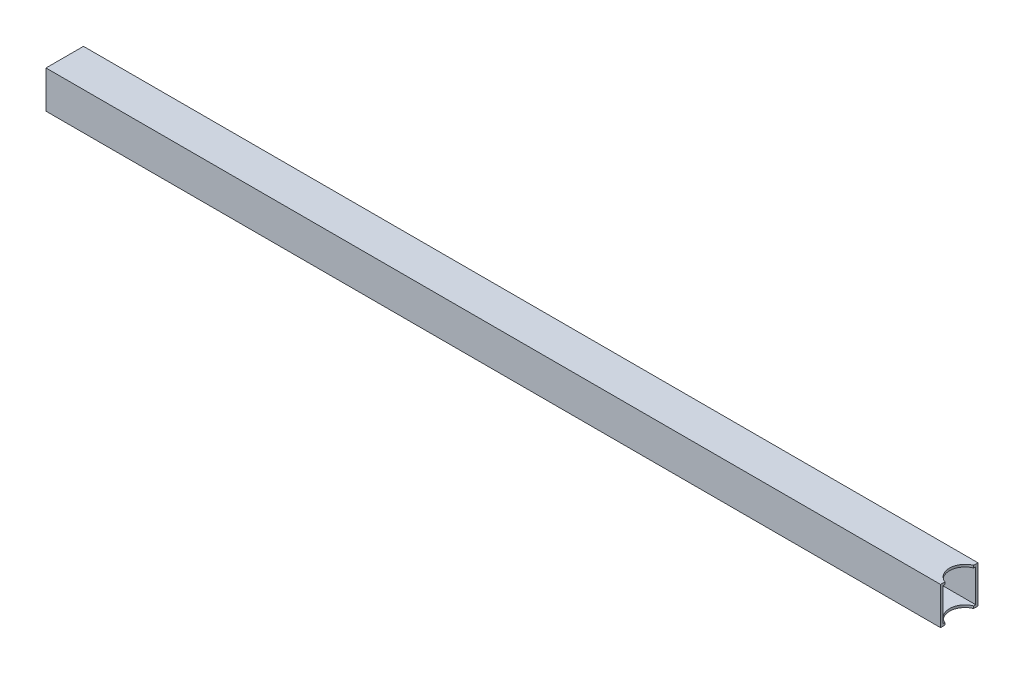
ISO-10303-21;
HEADER;
FILE_DESCRIPTION(('STEP AP214'),'2;1');
FILE_NAME('part.step','',(''),(''),'','','');
FILE_SCHEMA(('AUTOMOTIVE_DESIGN { 1 0 10303 214 1 1 1 1 }'));
ENDSEC;
DATA;
#1=APPLICATION_CONTEXT('core data for automotive mechanical design processes');
#2=APPLICATION_PROTOCOL_DEFINITION('international standard','automotive_design',2000,#1);
#3=PRODUCT_CONTEXT('',#1,'mechanical');
#4=PRODUCT('Part','Part','',(#3));
#5=PRODUCT_RELATED_PRODUCT_CATEGORY('part','',(#4));
#6=PRODUCT_DEFINITION_FORMATION('','',#4);
#7=PRODUCT_DEFINITION_CONTEXT('part definition',#1,'design');
#8=PRODUCT_DEFINITION('design','',#6,#7);
#9=PRODUCT_DEFINITION_SHAPE('','',#8);
#10=(LENGTH_UNIT() NAMED_UNIT(*) SI_UNIT(.MILLI.,.METRE.));
#11=(NAMED_UNIT(*) PLANE_ANGLE_UNIT() SI_UNIT($,.RADIAN.));
#12=(NAMED_UNIT(*) SI_UNIT($,.STERADIAN.) SOLID_ANGLE_UNIT());
#13=UNCERTAINTY_MEASURE_WITH_UNIT(LENGTH_MEASURE(1.E-05),#10,'distance_accuracy_value','');
#14=(GEOMETRIC_REPRESENTATION_CONTEXT(3) GLOBAL_UNCERTAINTY_ASSIGNED_CONTEXT((#13)) GLOBAL_UNIT_ASSIGNED_CONTEXT((#10,
#11,#12)) REPRESENTATION_CONTEXT('',''));
#15=CARTESIAN_POINT('',(0.,0.,0.));
#16=DIRECTION('',(0.,0.,1.));
#17=DIRECTION('',(1.,0.,0.));
#18=AXIS2_PLACEMENT_3D('',#15,#16,#17);
#19=CARTESIAN_POINT('',(622.3,1.66533453693773E-12,0.));
#20=DIRECTION('',(1.,0.,0.));
#21=DIRECTION('',(0.,0.,-1.));
#22=AXIS2_PLACEMENT_3D('',#19,#20,#21);
#23=PLANE('',#22);
#24=DIRECTION('',(0.,1.00000000000001,0.));
#25=VECTOR('',#24,1.);
#26=CARTESIAN_POINT('',(622.3,-25.3999999999987,-19.5306635255949));
#27=LINE('',#26,#25);
#28=CARTESIAN_POINT('',(622.3,-25.3999999999987,-19.5306635255949));
#29=VERTEX_POINT('',#28);
#30=CARTESIAN_POINT('',(622.3,-22.2249999999986,-19.5306635255949));
#31=VERTEX_POINT('',#30);
#32=EDGE_CURVE('E11',#29,#31,#27,.T.);
#33=ORIENTED_EDGE('',*,*,#32,.F.);
#34=DIRECTION('',(0.,0.,-1.));
#35=VECTOR('',#34,1.);
#36=CARTESIAN_POINT('',(622.3,-25.3999999999987,25.4));
#37=LINE('',#36,#35);
#38=CARTESIAN_POINT('',(622.3,-25.3999999999987,-25.4));
#39=VERTEX_POINT('',#38);
#40=EDGE_CURVE('E248',#29,#39,#37,.T.);
#41=ORIENTED_EDGE('',*,*,#40,.T.);
#42=DIRECTION('',(0.,1.00000000000001,0.));
#43=VECTOR('',#42,1.);
#44=CARTESIAN_POINT('',(622.3,-25.3999999999987,-25.4));
#45=LINE('',#44,#43);
#46=CARTESIAN_POINT('',(622.3,25.400000000002,-25.4));
#47=VERTEX_POINT('',#46);
#48=EDGE_CURVE('E152',#39,#47,#45,.T.);
#49=ORIENTED_EDGE('',*,*,#48,.T.);
#50=DIRECTION('',(0.,0.,1.));
#51=VECTOR('',#50,1.);
#52=CARTESIAN_POINT('',(622.3,25.400000000002,-25.4));
#53=LINE('',#52,#51);
#54=CARTESIAN_POINT('',(622.3,25.400000000002,-19.5306635255949));
#55=VERTEX_POINT('',#54);
#56=EDGE_CURVE('E143',#47,#55,#53,.T.);
#57=ORIENTED_EDGE('',*,*,#56,.T.);
#58=CARTESIAN_POINT('',(622.3,22.225000000002,-19.5306635255949));
#59=VERTEX_POINT('',#58);
#60=EDGE_CURVE('E47',#59,#55,#27,.T.);
#61=ORIENTED_EDGE('',*,*,#60,.F.);
#62=DIRECTION('',(0.,0.,1.));
#63=VECTOR('',#62,1.);
#64=CARTESIAN_POINT('',(622.3,22.225000000002,-22.225));
#65=LINE('',#64,#63);
#66=CARTESIAN_POINT('',(622.3,22.225000000002,-22.225));
#67=VERTEX_POINT('',#66);
#68=EDGE_CURVE('E234',#67,#59,#65,.T.);
#69=ORIENTED_EDGE('',*,*,#68,.F.);
#70=DIRECTION('',(0.,1.00000000000001,0.));
#71=VECTOR('',#70,1.);
#72=CARTESIAN_POINT('',(622.3,-22.2249999999986,-22.225));
#73=LINE('',#72,#71);
#74=CARTESIAN_POINT('',(622.3,-22.2249999999986,-22.225));
#75=VERTEX_POINT('',#74);
#76=EDGE_CURVE('E243',#75,#67,#73,.T.);
#77=ORIENTED_EDGE('',*,*,#76,.F.);
#78=DIRECTION('',(0.,0.,-1.));
#79=VECTOR('',#78,1.);
#80=CARTESIAN_POINT('',(622.3,-22.2249999999986,22.225));
#81=LINE('',#80,#79);
#82=EDGE_CURVE('E282',#31,#75,#81,.T.);
#83=ORIENTED_EDGE('',*,*,#82,.F.);
#84=EDGE_LOOP('',(#33,#41,#49,#57,#61,#69,#77,#83));
#85=FACE_BOUND('',#84,.T.);
#86=ADVANCED_FACE('F43',(#85),#23,.T.);
#87=CARTESIAN_POINT('',(-590.55,-25.4000000000019,-25.4));
#88=DIRECTION('',(0.,0.,-1.));
#89=DIRECTION('',(-1.,0.,0.));
#90=AXIS2_PLACEMENT_3D('',#87,#88,#89);
#91=PLANE('',#90);
#92=DIRECTION('',(1.,0.,0.));
#93=VECTOR('',#92,1.);
#94=CARTESIAN_POINT('',(-590.55,25.3999999999987,-25.4));
#95=LINE('',#94,#93);
#96=CARTESIAN_POINT('',(-590.55,25.3999999999987,-25.4));
#97=VERTEX_POINT('',#96);
#98=EDGE_CURVE('E210',#97,#47,#95,.T.);
#99=ORIENTED_EDGE('',*,*,#98,.T.);
#100=ORIENTED_EDGE('',*,*,#48,.F.);
#101=DIRECTION('',(1.,0.,0.));
#102=VECTOR('',#101,1.);
#103=CARTESIAN_POINT('',(-590.55,-25.4000000000019,-25.4));
#104=LINE('',#103,#102);
#105=CARTESIAN_POINT('',(-590.55,-25.4000000000019,-25.4));
#106=VERTEX_POINT('',#105);
#107=EDGE_CURVE('E211',#106,#39,#104,.T.);
#108=ORIENTED_EDGE('',*,*,#107,.F.);
#109=DIRECTION('',(0.,1.00000000000001,0.));
#110=VECTOR('',#109,1.);
#111=CARTESIAN_POINT('',(-590.55,-25.4000000000019,-25.4));
#112=LINE('',#111,#110);
#113=EDGE_CURVE('E185',#106,#97,#112,.T.);
#114=ORIENTED_EDGE('',*,*,#113,.T.);
#115=EDGE_LOOP('',(#99,#100,#108,#114));
#116=FACE_BOUND('',#115,.T.);
#117=ADVANCED_FACE('F45',(#116),#91,.T.);
#118=CARTESIAN_POINT('',(-590.55,-25.4000000000019,25.4));
#119=DIRECTION('',(0.,-1.00000000000001,0.));
#120=DIRECTION('',(0.,0.,-1.));
#121=AXIS2_PLACEMENT_3D('',#118,#119,#120);
#122=PLANE('',#121);
#123=CARTESIAN_POINT('',(630.2375,-25.3999999999987,0.));
#124=DIRECTION('',(0.,1.00000000000001,0.));
#125=DIRECTION('',(0.,0.,1.));
#126=AXIS2_PLACEMENT_3D('',#123,#124,#125);
#127=CIRCLE('',#126,21.0820000000001);
#128=CARTESIAN_POINT('',(622.3,-25.3999999999987,19.5306635255949));
#129=VERTEX_POINT('',#128);
#130=EDGE_CURVE('E147',#29,#129,#127,.T.);
#131=ORIENTED_EDGE('',*,*,#130,.T.);
#132=CARTESIAN_POINT('',(622.3,-25.3999999999987,25.4));
#133=VERTEX_POINT('',#132);
#134=EDGE_CURVE('E253',#133,#129,#37,.T.);
#135=ORIENTED_EDGE('',*,*,#134,.F.);
#136=DIRECTION('',(1.,0.,0.));
#137=VECTOR('',#136,1.);
#138=CARTESIAN_POINT('',(-590.55,-25.4000000000019,25.4));
#139=LINE('',#138,#137);
#140=CARTESIAN_POINT('',(-590.55,-25.4000000000019,25.4));
#141=VERTEX_POINT('',#140);
#142=EDGE_CURVE('E216',#141,#133,#139,.T.);
#143=ORIENTED_EDGE('',*,*,#142,.F.);
#144=DIRECTION('',(0.,0.,-1.));
#145=VECTOR('',#144,1.);
#146=CARTESIAN_POINT('',(-590.55,-25.4000000000019,25.4));
#147=LINE('',#146,#145);
#148=EDGE_CURVE('E206',#141,#106,#147,.T.);
#149=ORIENTED_EDGE('',*,*,#148,.T.);
#150=ORIENTED_EDGE('',*,*,#107,.T.);
#151=ORIENTED_EDGE('',*,*,#40,.F.);
#152=EDGE_LOOP('',(#131,#135,#143,#149,#150,#151));
#153=FACE_BOUND('',#152,.T.);
#154=ADVANCED_FACE('F264',(#153),#122,.T.);
#155=CARTESIAN_POINT('',(-590.55,-25.4000000000019,25.4));
#156=DIRECTION('',(0.,0.,1.));
#157=DIRECTION('',(1.,0.,0.));
#158=AXIS2_PLACEMENT_3D('',#155,#156,#157);
#159=PLANE('',#158);
#160=ORIENTED_EDGE('',*,*,#142,.T.);
#161=DIRECTION('',(0.,-1.00000000000001,0.));
#162=VECTOR('',#161,1.);
#163=CARTESIAN_POINT('',(622.3,25.400000000002,25.4));
#164=LINE('',#163,#162);
#165=CARTESIAN_POINT('',(622.3,25.400000000002,25.4));
#166=VERTEX_POINT('',#165);
#167=EDGE_CURVE('E154',#166,#133,#164,.T.);
#168=ORIENTED_EDGE('',*,*,#167,.F.);
#169=DIRECTION('',(1.,0.,0.));
#170=VECTOR('',#169,1.);
#171=CARTESIAN_POINT('',(-590.55,25.3999999999987,25.4));
#172=LINE('',#171,#170);
#173=CARTESIAN_POINT('',(-590.55,25.3999999999987,25.4));
#174=VERTEX_POINT('',#173);
#175=EDGE_CURVE('E219',#174,#166,#172,.T.);
#176=ORIENTED_EDGE('',*,*,#175,.F.);
#177=DIRECTION('',(0.,-1.00000000000001,0.));
#178=VECTOR('',#177,1.);
#179=CARTESIAN_POINT('',(-590.55,-25.4000000000019,25.4));
#180=LINE('',#179,#178);
#181=EDGE_CURVE('E202',#174,#141,#180,.T.);
#182=ORIENTED_EDGE('',*,*,#181,.T.);
#183=EDGE_LOOP('',(#160,#168,#176,#182));
#184=FACE_BOUND('',#183,.T.);
#185=ADVANCED_FACE('F273',(#184),#159,.T.);
#186=CARTESIAN_POINT('',(-590.55,25.3999999999987,25.4));
#187=DIRECTION('',(0.,1.00000000000001,0.));
#188=DIRECTION('',(0.,0.,1.));
#189=AXIS2_PLACEMENT_3D('',#186,#187,#188);
#190=PLANE('',#189);
#191=CARTESIAN_POINT('',(630.2375,25.400000000002,0.));
#192=DIRECTION('',(0.,1.00000000000001,0.));
#193=DIRECTION('',(0.,0.,1.));
#194=AXIS2_PLACEMENT_3D('',#191,#192,#193);
#195=CIRCLE('',#194,21.0820000000001);
#196=CARTESIAN_POINT('',(622.3,25.400000000002,19.5306635255949));
#197=VERTEX_POINT('',#196);
#198=EDGE_CURVE('E66',#55,#197,#195,.T.);
#199=ORIENTED_EDGE('',*,*,#198,.F.);
#200=ORIENTED_EDGE('',*,*,#56,.F.);
#201=ORIENTED_EDGE('',*,*,#98,.F.);
#202=DIRECTION('',(0.,0.,1.));
#203=VECTOR('',#202,1.);
#204=CARTESIAN_POINT('',(-590.55,25.3999999999987,25.4));
#205=LINE('',#204,#203);
#206=EDGE_CURVE('E198',#97,#174,#205,.T.);
#207=ORIENTED_EDGE('',*,*,#206,.T.);
#208=ORIENTED_EDGE('',*,*,#175,.T.);
#209=EDGE_CURVE('E145',#197,#166,#53,.T.);
#210=ORIENTED_EDGE('',*,*,#209,.F.);
#211=EDGE_LOOP('',(#199,#200,#201,#207,#208,#210));
#212=FACE_BOUND('',#211,.T.);
#213=ADVANCED_FACE('F142',(#212),#190,.T.);
#214=CARTESIAN_POINT('',(-590.55,-1.58206781009085E-12,0.));
#215=DIRECTION('',(-1.,0.,0.));
#216=DIRECTION('',(0.,0.,1.));
#217=AXIS2_PLACEMENT_3D('',#214,#215,#216);
#218=PLANE('',#217);
#219=DIRECTION('',(0.,1.00000000000001,0.));
#220=VECTOR('',#219,1.);
#221=CARTESIAN_POINT('',(-590.55,-22.2250000000018,-22.225));
#222=LINE('',#221,#220);
#223=CARTESIAN_POINT('',(-590.55,-22.2250000000018,-22.225));
#224=VERTEX_POINT('',#223);
#225=CARTESIAN_POINT('',(-590.55,22.2249999999987,-22.225));
#226=VERTEX_POINT('',#225);
#227=EDGE_CURVE('E160',#224,#226,#222,.T.);
#228=ORIENTED_EDGE('',*,*,#227,.T.);
#229=DIRECTION('',(0.,0.,1.));
#230=VECTOR('',#229,1.);
#231=CARTESIAN_POINT('',(-590.55,22.2249999999987,22.225));
#232=LINE('',#231,#230);
#233=CARTESIAN_POINT('',(-590.55,22.2249999999987,22.225));
#234=VERTEX_POINT('',#233);
#235=EDGE_CURVE('E168',#226,#234,#232,.T.);
#236=ORIENTED_EDGE('',*,*,#235,.T.);
#237=DIRECTION('',(0.,-1.00000000000001,0.));
#238=VECTOR('',#237,1.);
#239=CARTESIAN_POINT('',(-590.55,-22.2250000000018,22.225));
#240=LINE('',#239,#238);
#241=CARTESIAN_POINT('',(-590.55,-22.2250000000018,22.225));
#242=VERTEX_POINT('',#241);
#243=EDGE_CURVE('E172',#234,#242,#240,.T.);
#244=ORIENTED_EDGE('',*,*,#243,.T.);
#245=DIRECTION('',(0.,0.,-1.));
#246=VECTOR('',#245,1.);
#247=CARTESIAN_POINT('',(-590.55,-22.2250000000018,22.225));
#248=LINE('',#247,#246);
#249=EDGE_CURVE('E176',#242,#224,#248,.T.);
#250=ORIENTED_EDGE('',*,*,#249,.T.);
#251=EDGE_LOOP('',(#228,#236,#244,#250));
#252=FACE_BOUND('',#251,.T.);
#253=ORIENTED_EDGE('',*,*,#113,.F.);
#254=ORIENTED_EDGE('',*,*,#148,.F.);
#255=ORIENTED_EDGE('',*,*,#181,.F.);
#256=ORIENTED_EDGE('',*,*,#206,.F.);
#257=EDGE_LOOP('',(#253,#254,#255,#256));
#258=FACE_BOUND('',#257,.T.);
#259=ADVANCED_FACE('F271',(#252,#258),#218,.T.);
#260=CARTESIAN_POINT('',(-590.55,-22.2250000000018,-22.225));
#261=DIRECTION('',(0.,0.,-1.));
#262=DIRECTION('',(-1.,0.,0.));
#263=AXIS2_PLACEMENT_3D('',#260,#261,#262);
#264=PLANE('',#263);
#265=DIRECTION('',(1.,0.,0.));
#266=VECTOR('',#265,1.);
#267=CARTESIAN_POINT('',(-590.55,-22.2250000000018,-22.225));
#268=LINE('',#267,#266);
#269=EDGE_CURVE('E181',#224,#75,#268,.T.);
#270=ORIENTED_EDGE('',*,*,#269,.T.);
#271=ORIENTED_EDGE('',*,*,#76,.T.);
#272=DIRECTION('',(1.,0.,0.));
#273=VECTOR('',#272,1.);
#274=CARTESIAN_POINT('',(-590.55,22.2249999999987,-22.225));
#275=LINE('',#274,#273);
#276=EDGE_CURVE('E180',#226,#67,#275,.T.);
#277=ORIENTED_EDGE('',*,*,#276,.F.);
#278=ORIENTED_EDGE('',*,*,#227,.F.);
#279=EDGE_LOOP('',(#270,#271,#277,#278));
#280=FACE_BOUND('',#279,.T.);
#281=ADVANCED_FACE('F294',(#280),#264,.F.);
#282=CARTESIAN_POINT('',(-590.55,-22.2250000000018,22.225));
#283=DIRECTION('',(0.,-1.00000000000001,0.));
#284=DIRECTION('',(0.,0.,-1.));
#285=AXIS2_PLACEMENT_3D('',#282,#283,#284);
#286=PLANE('',#285);
#287=CARTESIAN_POINT('',(622.3,-22.2249999999986,22.225));
#288=VERTEX_POINT('',#287);
#289=CARTESIAN_POINT('',(622.3,-22.2249999999986,19.5306635255949));
#290=VERTEX_POINT('',#289);
#291=EDGE_CURVE('E250',#288,#290,#81,.T.);
#292=ORIENTED_EDGE('',*,*,#291,.T.);
#293=CARTESIAN_POINT('',(630.2375,-22.2249999999986,0.));
#294=DIRECTION('',(0.,-1.00000000000001,0.));
#295=DIRECTION('',(0.,0.,-1.));
#296=AXIS2_PLACEMENT_3D('',#293,#294,#295);
#297=CIRCLE('',#296,21.0820000000001);
#298=EDGE_CURVE('E58',#290,#31,#297,.T.);
#299=ORIENTED_EDGE('',*,*,#298,.T.);
#300=ORIENTED_EDGE('',*,*,#82,.T.);
#301=ORIENTED_EDGE('',*,*,#269,.F.);
#302=ORIENTED_EDGE('',*,*,#249,.F.);
#303=DIRECTION('',(1.,0.,0.));
#304=VECTOR('',#303,1.);
#305=CARTESIAN_POINT('',(-590.55,-22.2250000000018,22.225));
#306=LINE('',#305,#304);
#307=EDGE_CURVE('E186',#242,#288,#306,.T.);
#308=ORIENTED_EDGE('',*,*,#307,.T.);
#309=EDGE_LOOP('',(#292,#299,#300,#301,#302,#308));
#310=FACE_BOUND('',#309,.T.);
#311=ADVANCED_FACE('F289',(#310),#286,.F.);
#312=CARTESIAN_POINT('',(-590.55,-22.2250000000018,22.225));
#313=DIRECTION('',(0.,0.,1.));
#314=DIRECTION('',(1.,0.,0.));
#315=AXIS2_PLACEMENT_3D('',#312,#313,#314);
#316=PLANE('',#315);
#317=DIRECTION('',(1.,0.,0.));
#318=VECTOR('',#317,1.);
#319=CARTESIAN_POINT('',(-590.55,22.2249999999987,22.225));
#320=LINE('',#319,#318);
#321=CARTESIAN_POINT('',(622.3,22.225000000002,22.225));
#322=VERTEX_POINT('',#321);
#323=EDGE_CURVE('E189',#234,#322,#320,.T.);
#324=ORIENTED_EDGE('',*,*,#323,.T.);
#325=DIRECTION('',(0.,-1.00000000000001,0.));
#326=VECTOR('',#325,1.);
#327=CARTESIAN_POINT('',(622.3,22.225000000002,22.225));
#328=LINE('',#327,#326);
#329=EDGE_CURVE('E236',#322,#288,#328,.T.);
#330=ORIENTED_EDGE('',*,*,#329,.T.);
#331=ORIENTED_EDGE('',*,*,#307,.F.);
#332=ORIENTED_EDGE('',*,*,#243,.F.);
#333=EDGE_LOOP('',(#324,#330,#331,#332));
#334=FACE_BOUND('',#333,.T.);
#335=ADVANCED_FACE('F298',(#334),#316,.F.);
#336=CARTESIAN_POINT('',(-590.55,22.2249999999987,22.225));
#337=DIRECTION('',(0.,1.00000000000001,0.));
#338=DIRECTION('',(0.,0.,1.));
#339=AXIS2_PLACEMENT_3D('',#336,#337,#338);
#340=PLANE('',#339);
#341=ORIENTED_EDGE('',*,*,#68,.T.);
#342=CARTESIAN_POINT('',(630.2375,22.225000000002,0.));
#343=DIRECTION('',(0.,1.00000000000001,0.));
#344=DIRECTION('',(0.,0.,1.));
#345=AXIS2_PLACEMENT_3D('',#342,#343,#344);
#346=CIRCLE('',#345,21.0820000000001);
#347=CARTESIAN_POINT('',(622.3,22.225000000002,19.5306635255949));
#348=VERTEX_POINT('',#347);
#349=EDGE_CURVE('E132',#59,#348,#346,.T.);
#350=ORIENTED_EDGE('',*,*,#349,.T.);
#351=EDGE_CURVE('E233',#348,#322,#65,.T.);
#352=ORIENTED_EDGE('',*,*,#351,.T.);
#353=ORIENTED_EDGE('',*,*,#323,.F.);
#354=ORIENTED_EDGE('',*,*,#235,.F.);
#355=ORIENTED_EDGE('',*,*,#276,.T.);
#356=EDGE_LOOP('',(#341,#350,#352,#353,#354,#355));
#357=FACE_BOUND('',#356,.T.);
#358=ADVANCED_FACE('F231',(#357),#340,.F.);
#359=DIRECTION('',(0.,1.00000000000001,0.));
#360=VECTOR('',#359,1.);
#361=CARTESIAN_POINT('',(622.3,-25.3999999999987,19.5306635255949));
#362=LINE('',#361,#360);
#363=EDGE_CURVE('E138',#197,#348,#362,.F.);
#364=ORIENTED_EDGE('',*,*,#363,.F.);
#365=ORIENTED_EDGE('',*,*,#209,.T.);
#366=ORIENTED_EDGE('',*,*,#167,.T.);
#367=ORIENTED_EDGE('',*,*,#134,.T.);
#368=EDGE_CURVE('E215',#290,#129,#362,.F.);
#369=ORIENTED_EDGE('',*,*,#368,.F.);
#370=ORIENTED_EDGE('',*,*,#291,.F.);
#371=ORIENTED_EDGE('',*,*,#329,.F.);
#372=ORIENTED_EDGE('',*,*,#351,.F.);
#373=EDGE_LOOP('',(#364,#365,#366,#367,#369,#370,#371,#372));
#374=FACE_BOUND('',#373,.T.);
#375=ADVANCED_FACE('F239',(#374),#23,.T.);
#376=CARTESIAN_POINT('',(630.2375,-25.3999999999987,0.));
#377=DIRECTION('',(0.,1.00000000000001,0.));
#378=DIRECTION('',(0.,0.,1.));
#379=AXIS2_PLACEMENT_3D('',#376,#377,#378);
#380=CYLINDRICAL_SURFACE('',#379,21.0820000000001);
#381=ORIENTED_EDGE('',*,*,#32,.T.);
#382=ORIENTED_EDGE('',*,*,#298,.F.);
#383=ORIENTED_EDGE('',*,*,#368,.T.);
#384=ORIENTED_EDGE('',*,*,#130,.F.);
#385=EDGE_LOOP('',(#381,#382,#383,#384));
#386=FACE_BOUND('',#385,.T.);
#387=ADVANCED_FACE('F314',(#386),#380,.F.);
#388=ORIENTED_EDGE('',*,*,#60,.T.);
#389=ORIENTED_EDGE('',*,*,#198,.T.);
#390=ORIENTED_EDGE('',*,*,#363,.T.);
#391=ORIENTED_EDGE('',*,*,#349,.F.);
#392=EDGE_LOOP('',(#388,#389,#390,#391));
#393=FACE_BOUND('',#392,.T.);
#394=ADVANCED_FACE('F130',(#393),#380,.F.);
#395=CLOSED_SHELL('',(#86,#117,#154,#185,#213,#259,#281,#311,#335,#358,#375,#387,#394));
#396=MANIFOLD_SOLID_BREP('B2',#395);
#397=ADVANCED_BREP_SHAPE_REPRESENTATION('',(#18,#396),#14);
#398=SHAPE_DEFINITION_REPRESENTATION(#9,#397);
ENDSEC;
END-ISO-10303-21;
